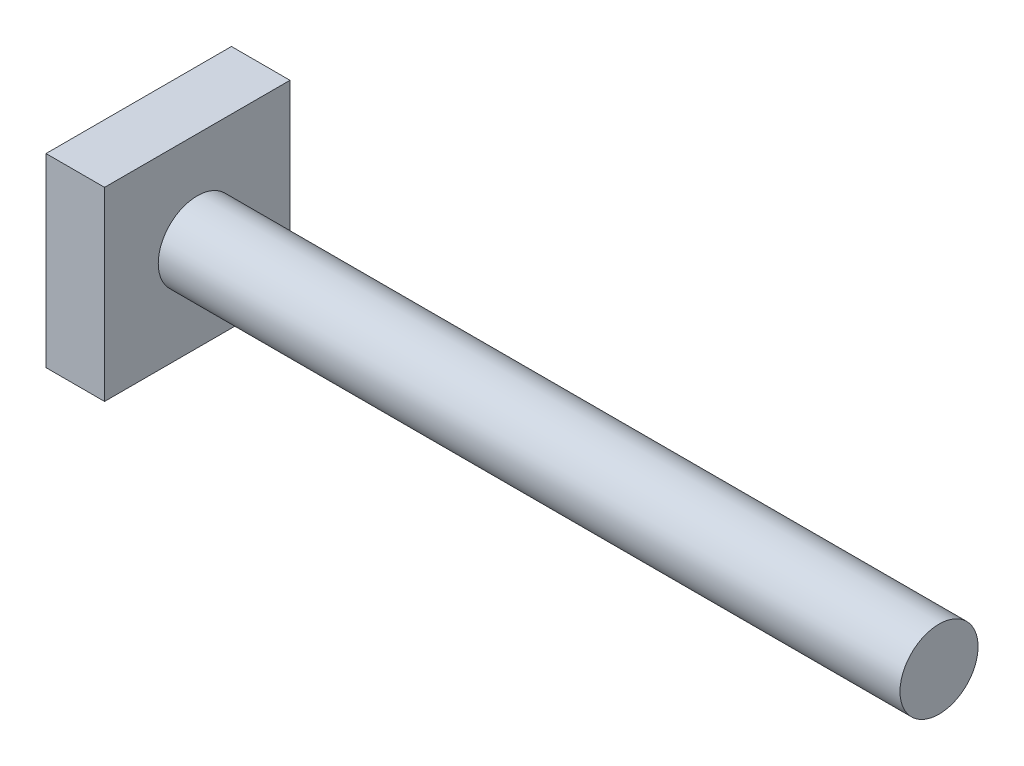
ISO-10303-21;
HEADER;
FILE_DESCRIPTION(('STEP AP214'),'2;1');
FILE_NAME('part.step','',(''),(''),'','','');
FILE_SCHEMA(('AUTOMOTIVE_DESIGN { 1 0 10303 214 1 1 1 1 }'));
ENDSEC;
DATA;
#1=APPLICATION_CONTEXT('core data for automotive mechanical design processes');
#2=APPLICATION_PROTOCOL_DEFINITION('international standard','automotive_design',2000,#1);
#3=PRODUCT_CONTEXT('',#1,'mechanical');
#4=PRODUCT('Part','Part','',(#3));
#5=PRODUCT_RELATED_PRODUCT_CATEGORY('part','',(#4));
#6=PRODUCT_DEFINITION_FORMATION('','',#4);
#7=PRODUCT_DEFINITION_CONTEXT('part definition',#1,'design');
#8=PRODUCT_DEFINITION('design','',#6,#7);
#9=PRODUCT_DEFINITION_SHAPE('','',#8);
#10=(LENGTH_UNIT() NAMED_UNIT(*) SI_UNIT(.MILLI.,.METRE.));
#11=(NAMED_UNIT(*) PLANE_ANGLE_UNIT() SI_UNIT($,.RADIAN.));
#12=(NAMED_UNIT(*) SI_UNIT($,.STERADIAN.) SOLID_ANGLE_UNIT());
#13=UNCERTAINTY_MEASURE_WITH_UNIT(LENGTH_MEASURE(1.E-05),#10,'distance_accuracy_value','');
#14=(GEOMETRIC_REPRESENTATION_CONTEXT(3) GLOBAL_UNCERTAINTY_ASSIGNED_CONTEXT((#13)) GLOBAL_UNIT_ASSIGNED_CONTEXT((#10,
#11,#12)) REPRESENTATION_CONTEXT('',''));
#15=CARTESIAN_POINT('',(0.,0.,0.));
#16=DIRECTION('',(0.,0.,1.));
#17=DIRECTION('',(1.,0.,0.));
#18=AXIS2_PLACEMENT_3D('',#15,#16,#17);
#19=CARTESIAN_POINT('',(76.,0.,0.));
#20=DIRECTION('',(-1.,0.,0.));
#21=DIRECTION('',(0.,0.,1.));
#22=AXIS2_PLACEMENT_3D('',#19,#20,#21);
#23=PLANE('',#22);
#24=CARTESIAN_POINT('',(76.,0.,0.));
#25=DIRECTION('',(-1.,0.,0.));
#26=DIRECTION('',(0.,0.,1.));
#27=AXIS2_PLACEMENT_3D('',#24,#25,#26);
#28=CIRCLE('',#27,4.00000000000001);
#29=CARTESIAN_POINT('',(76.,0.,4.00000000000001));
#30=VERTEX_POINT('',#29);
#31=EDGE_CURVE('E11',#30,#30,#28,.T.);
#32=ORIENTED_EDGE('',*,*,#31,.F.);
#33=EDGE_LOOP('',(#32));
#34=FACE_BOUND('',#33,.T.);
#35=ADVANCED_FACE('F33',(#34),#23,.F.);
#36=CARTESIAN_POINT('',(0.,0.,0.));
#37=DIRECTION('',(-1.,0.,0.));
#38=DIRECTION('',(0.,0.,1.));
#39=AXIS2_PLACEMENT_3D('',#36,#37,#38);
#40=CYLINDRICAL_SURFACE('',#39,4.);
#41=CARTESIAN_POINT('',(0.,0.,0.));
#42=DIRECTION('',(-1.,0.,0.));
#43=DIRECTION('',(0.,0.,1.));
#44=AXIS2_PLACEMENT_3D('',#41,#42,#43);
#45=CIRCLE('',#44,4.);
#46=CARTESIAN_POINT('',(0.,0.,4.));
#47=VERTEX_POINT('',#46);
#48=EDGE_CURVE('E41',#47,#47,#45,.T.);
#49=ORIENTED_EDGE('',*,*,#48,.F.);
#50=EDGE_LOOP('',(#49));
#51=FACE_BOUND('',#50,.T.);
#52=ORIENTED_EDGE('',*,*,#31,.T.);
#53=EDGE_LOOP('',(#52));
#54=FACE_BOUND('',#53,.T.);
#55=ADVANCED_FACE('F114',(#51,#54),#40,.T.);
#56=CARTESIAN_POINT('',(-6.,9.5,9.5));
#57=DIRECTION('',(0.,0.,-1.));
#58=DIRECTION('',(0.,1.,0.));
#59=AXIS2_PLACEMENT_3D('',#56,#57,#58);
#60=PLANE('',#59);
#61=DIRECTION('',(0.,1.,0.));
#62=VECTOR('',#61,1.);
#63=CARTESIAN_POINT('',(0.,9.5,9.5));
#64=LINE('',#63,#62);
#65=CARTESIAN_POINT('',(0.,-9.5,9.5));
#66=VERTEX_POINT('',#65);
#67=CARTESIAN_POINT('',(0.,9.5,9.5));
#68=VERTEX_POINT('',#67);
#69=EDGE_CURVE('E100',#66,#68,#64,.T.);
#70=ORIENTED_EDGE('',*,*,#69,.T.);
#71=DIRECTION('',(1.,0.,0.));
#72=VECTOR('',#71,1.);
#73=CARTESIAN_POINT('',(-6.,9.5,9.5));
#74=LINE('',#73,#72);
#75=CARTESIAN_POINT('',(-6.,9.5,9.5));
#76=VERTEX_POINT('',#75);
#77=EDGE_CURVE('E91',#76,#68,#74,.T.);
#78=ORIENTED_EDGE('',*,*,#77,.F.);
#79=DIRECTION('',(0.,1.,0.));
#80=VECTOR('',#79,1.);
#81=CARTESIAN_POINT('',(-6.,9.5,9.5));
#82=LINE('',#81,#80);
#83=CARTESIAN_POINT('',(-6.,-9.5,9.5));
#84=VERTEX_POINT('',#83);
#85=EDGE_CURVE('E85',#84,#76,#82,.T.);
#86=ORIENTED_EDGE('',*,*,#85,.F.);
#87=DIRECTION('',(1.,0.,0.));
#88=VECTOR('',#87,1.);
#89=CARTESIAN_POINT('',(-6.,-9.5,9.5));
#90=LINE('',#89,#88);
#91=EDGE_CURVE('E96',#84,#66,#90,.T.);
#92=ORIENTED_EDGE('',*,*,#91,.T.);
#93=EDGE_LOOP('',(#70,#78,#86,#92));
#94=FACE_BOUND('',#93,.T.);
#95=ADVANCED_FACE('F117',(#94),#60,.F.);
#96=CARTESIAN_POINT('',(-6.,9.5,-9.5));
#97=DIRECTION('',(0.,-1.,0.));
#98=DIRECTION('',(0.,0.,-1.));
#99=AXIS2_PLACEMENT_3D('',#96,#97,#98);
#100=PLANE('',#99);
#101=DIRECTION('',(0.,0.,-1.));
#102=VECTOR('',#101,1.);
#103=CARTESIAN_POINT('',(0.,9.5,-9.5));
#104=LINE('',#103,#102);
#105=CARTESIAN_POINT('',(0.,9.5,-9.5));
#106=VERTEX_POINT('',#105);
#107=EDGE_CURVE('E90',#68,#106,#104,.T.);
#108=ORIENTED_EDGE('',*,*,#107,.T.);
#109=DIRECTION('',(1.,0.,0.));
#110=VECTOR('',#109,1.);
#111=CARTESIAN_POINT('',(-6.,9.5,-9.5));
#112=LINE('',#111,#110);
#113=CARTESIAN_POINT('',(-6.,9.5,-9.5));
#114=VERTEX_POINT('',#113);
#115=EDGE_CURVE('E88',#114,#106,#112,.T.);
#116=ORIENTED_EDGE('',*,*,#115,.F.);
#117=DIRECTION('',(0.,0.,-1.));
#118=VECTOR('',#117,1.);
#119=CARTESIAN_POINT('',(-6.,9.5,-9.5));
#120=LINE('',#119,#118);
#121=EDGE_CURVE('E80',#76,#114,#120,.T.);
#122=ORIENTED_EDGE('',*,*,#121,.F.);
#123=ORIENTED_EDGE('',*,*,#77,.T.);
#124=EDGE_LOOP('',(#108,#116,#122,#123));
#125=FACE_BOUND('',#124,.T.);
#126=ADVANCED_FACE('F89',(#125),#100,.F.);
#127=CARTESIAN_POINT('',(-6.,9.5,-9.5));
#128=DIRECTION('',(0.,0.,1.));
#129=DIRECTION('',(0.,-1.,0.));
#130=AXIS2_PLACEMENT_3D('',#127,#128,#129);
#131=PLANE('',#130);
#132=DIRECTION('',(0.,-1.,0.));
#133=VECTOR('',#132,1.);
#134=CARTESIAN_POINT('',(0.,9.5,-9.5));
#135=LINE('',#134,#133);
#136=CARTESIAN_POINT('',(0.,-9.5,-9.5));
#137=VERTEX_POINT('',#136);
#138=EDGE_CURVE('E66',#106,#137,#135,.T.);
#139=ORIENTED_EDGE('',*,*,#138,.T.);
#140=DIRECTION('',(1.,0.,0.));
#141=VECTOR('',#140,1.);
#142=CARTESIAN_POINT('',(-6.,-9.5,-9.5));
#143=LINE('',#142,#141);
#144=CARTESIAN_POINT('',(-6.,-9.5,-9.5));
#145=VERTEX_POINT('',#144);
#146=EDGE_CURVE('E92',#145,#137,#143,.T.);
#147=ORIENTED_EDGE('',*,*,#146,.F.);
#148=DIRECTION('',(0.,-1.,0.));
#149=VECTOR('',#148,1.);
#150=CARTESIAN_POINT('',(-6.,9.5,-9.5));
#151=LINE('',#150,#149);
#152=EDGE_CURVE('E83',#114,#145,#151,.T.);
#153=ORIENTED_EDGE('',*,*,#152,.F.);
#154=ORIENTED_EDGE('',*,*,#115,.T.);
#155=EDGE_LOOP('',(#139,#147,#153,#154));
#156=FACE_BOUND('',#155,.T.);
#157=ADVANCED_FACE('F94',(#156),#131,.F.);
#158=CARTESIAN_POINT('',(-6.,-9.5,-9.5));
#159=DIRECTION('',(0.,1.,0.));
#160=DIRECTION('',(0.,0.,1.));
#161=AXIS2_PLACEMENT_3D('',#158,#159,#160);
#162=PLANE('',#161);
#163=DIRECTION('',(0.,0.,1.));
#164=VECTOR('',#163,1.);
#165=CARTESIAN_POINT('',(0.,-9.5,-9.5));
#166=LINE('',#165,#164);
#167=EDGE_CURVE('E72',#137,#66,#166,.T.);
#168=ORIENTED_EDGE('',*,*,#167,.T.);
#169=ORIENTED_EDGE('',*,*,#91,.F.);
#170=DIRECTION('',(0.,0.,1.));
#171=VECTOR('',#170,1.);
#172=CARTESIAN_POINT('',(-6.,-9.5,-9.5));
#173=LINE('',#172,#171);
#174=EDGE_CURVE('E49',#145,#84,#173,.T.);
#175=ORIENTED_EDGE('',*,*,#174,.F.);
#176=ORIENTED_EDGE('',*,*,#146,.T.);
#177=EDGE_LOOP('',(#168,#169,#175,#176));
#178=FACE_BOUND('',#177,.T.);
#179=ADVANCED_FACE('F146',(#178),#162,.F.);
#180=CARTESIAN_POINT('',(-6.,0.,0.));
#181=DIRECTION('',(-1.,0.,0.));
#182=DIRECTION('',(0.,0.,1.));
#183=AXIS2_PLACEMENT_3D('',#180,#181,#182);
#184=PLANE('',#183);
#185=ORIENTED_EDGE('',*,*,#85,.T.);
#186=ORIENTED_EDGE('',*,*,#121,.T.);
#187=ORIENTED_EDGE('',*,*,#152,.T.);
#188=ORIENTED_EDGE('',*,*,#174,.T.);
#189=EDGE_LOOP('',(#185,#186,#187,#188));
#190=FACE_BOUND('',#189,.T.);
#191=ADVANCED_FACE('F81',(#190),#184,.T.);
#192=CARTESIAN_POINT('',(0.,0.,0.));
#193=DIRECTION('',(-1.,0.,0.));
#194=DIRECTION('',(0.,0.,1.));
#195=AXIS2_PLACEMENT_3D('',#192,#193,#194);
#196=PLANE('',#195);
#197=ORIENTED_EDGE('',*,*,#48,.T.);
#198=EDGE_LOOP('',(#197));
#199=FACE_BOUND('',#198,.T.);
#200=ORIENTED_EDGE('',*,*,#69,.F.);
#201=ORIENTED_EDGE('',*,*,#167,.F.);
#202=ORIENTED_EDGE('',*,*,#138,.F.);
#203=ORIENTED_EDGE('',*,*,#107,.F.);
#204=EDGE_LOOP('',(#200,#201,#202,#203));
#205=FACE_BOUND('',#204,.T.);
#206=ADVANCED_FACE('F111',(#199,#205),#196,.F.);
#207=CLOSED_SHELL('',(#35,#55,#95,#126,#157,#179,#191,#206));
#208=MANIFOLD_SOLID_BREP('B2',#207);
#209=ADVANCED_BREP_SHAPE_REPRESENTATION('',(#18,#208),#14);
#210=SHAPE_DEFINITION_REPRESENTATION(#9,#209);
ENDSEC;
END-ISO-10303-21;
